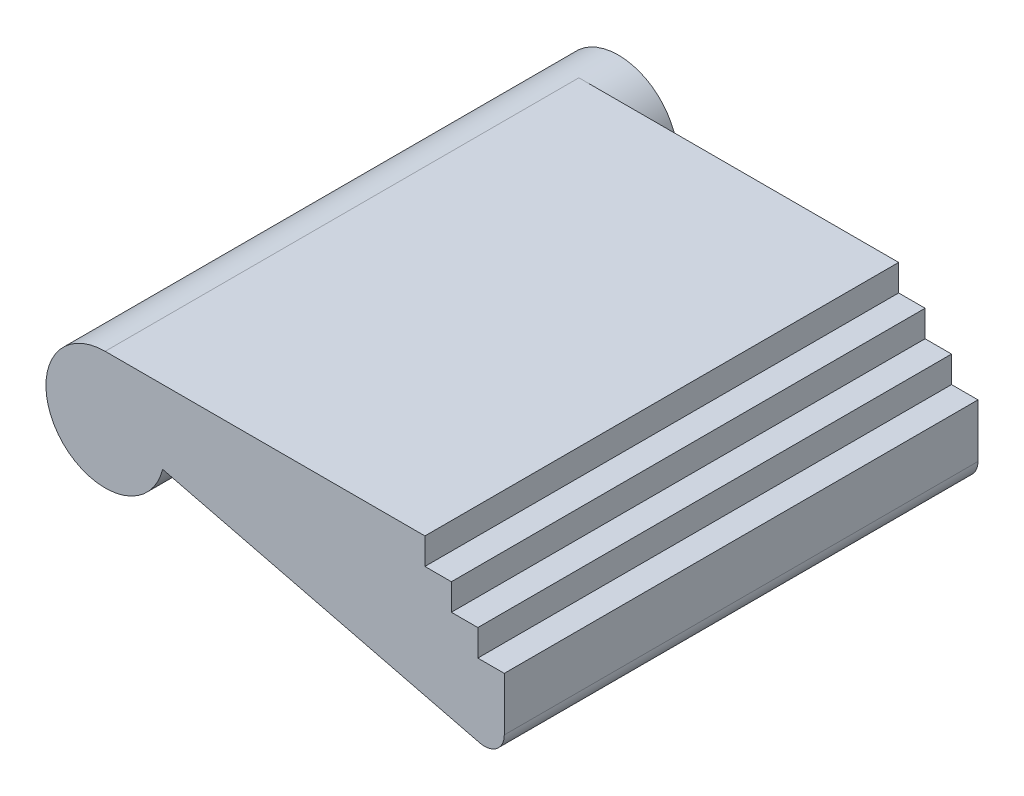
ISO-10303-21;
HEADER;
FILE_DESCRIPTION(('STEP AP214'),'2;1');
FILE_NAME('part.step','',(''),(''),'','','');
FILE_SCHEMA(('AUTOMOTIVE_DESIGN { 1 0 10303 214 1 1 1 1 }'));
ENDSEC;
DATA;
#1=APPLICATION_CONTEXT('core data for automotive mechanical design processes');
#2=APPLICATION_PROTOCOL_DEFINITION('international standard','automotive_design',2000,#1);
#3=PRODUCT_CONTEXT('',#1,'mechanical');
#4=PRODUCT('Part','Part','',(#3));
#5=PRODUCT_RELATED_PRODUCT_CATEGORY('part','',(#4));
#6=PRODUCT_DEFINITION_FORMATION('','',#4);
#7=PRODUCT_DEFINITION_CONTEXT('part definition',#1,'design');
#8=PRODUCT_DEFINITION('design','',#6,#7);
#9=PRODUCT_DEFINITION_SHAPE('','',#8);
#10=(LENGTH_UNIT() NAMED_UNIT(*) SI_UNIT(.MILLI.,.METRE.));
#11=(NAMED_UNIT(*) PLANE_ANGLE_UNIT() SI_UNIT($,.RADIAN.));
#12=(NAMED_UNIT(*) SI_UNIT($,.STERADIAN.) SOLID_ANGLE_UNIT());
#13=UNCERTAINTY_MEASURE_WITH_UNIT(LENGTH_MEASURE(1.E-05),#10,'distance_accuracy_value','');
#14=(GEOMETRIC_REPRESENTATION_CONTEXT(3) GLOBAL_UNCERTAINTY_ASSIGNED_CONTEXT((#13)) GLOBAL_UNIT_ASSIGNED_CONTEXT((#10,
#11,#12)) REPRESENTATION_CONTEXT('',''));
#15=CARTESIAN_POINT('',(0.,0.,0.));
#16=DIRECTION('',(0.,0.,1.));
#17=DIRECTION('',(1.,0.,0.));
#18=AXIS2_PLACEMENT_3D('',#15,#16,#17);
#19=CARTESIAN_POINT('',(0.,0.,13.));
#20=DIRECTION('',(0.,0.,-1.));
#21=DIRECTION('',(-1.,0.,0.));
#22=AXIS2_PLACEMENT_3D('',#19,#20,#21);
#23=CYLINDRICAL_SURFACE('',#22,1.5);
#24=CARTESIAN_POINT('',(0.,0.,13.));
#25=DIRECTION('',(0.,0.,1.));
#26=DIRECTION('',(1.,0.,0.));
#27=AXIS2_PLACEMENT_3D('',#24,#25,#26);
#28=CIRCLE('',#27,1.5);
#29=CARTESIAN_POINT('',(0.,1.5,13.));
#30=VERTEX_POINT('',#29);
#31=CARTESIAN_POINT('',(1.45614093271806,-0.360074414618708,13.));
#32=VERTEX_POINT('',#31);
#33=EDGE_CURVE('E195',#30,#32,#28,.T.);
#34=ORIENTED_EDGE('',*,*,#33,.F.);
#35=DIRECTION('',(0.,0.,1.));
#36=VECTOR('',#35,1.);
#37=CARTESIAN_POINT('',(0.,1.5,0.999999999999999));
#38=LINE('',#37,#36);
#39=CARTESIAN_POINT('',(0.,1.5,0.999999999999999));
#40=VERTEX_POINT('',#39);
#41=EDGE_CURVE('E177',#40,#30,#38,.T.);
#42=ORIENTED_EDGE('',*,*,#41,.F.);
#43=CARTESIAN_POINT('',(0.,0.,0.999999999999999));
#44=DIRECTION('',(0.,0.,-1.));
#45=DIRECTION('',(-1.,0.,0.));
#46=AXIS2_PLACEMENT_3D('',#43,#44,#45);
#47=CIRCLE('',#46,1.5);
#48=CARTESIAN_POINT('',(1.45614093271805,-0.360074414618707,0.999999999999999));
#49=VERTEX_POINT('',#48);
#50=EDGE_CURVE('E198',#40,#49,#47,.T.);
#51=ORIENTED_EDGE('',*,*,#50,.T.);
#52=DIRECTION('',(0.,0.,-1.));
#53=VECTOR('',#52,1.);
#54=CARTESIAN_POINT('',(1.45614093271805,-0.360074414618706,13.));
#55=LINE('',#54,#53);
#56=EDGE_CURVE('E180',#49,#32,#55,.F.);
#57=ORIENTED_EDGE('',*,*,#56,.T.);
#58=EDGE_LOOP('',(#34,#42,#51,#57));
#59=FACE_BOUND('',#58,.T.);
#60=CARTESIAN_POINT('',(0.,0.,0.));
#61=DIRECTION('',(0.,0.,1.));
#62=DIRECTION('',(1.,0.,0.));
#63=AXIS2_PLACEMENT_3D('',#60,#61,#62);
#64=CIRCLE('',#63,1.5);
#65=CARTESIAN_POINT('',(1.5,0.,0.));
#66=VERTEX_POINT('',#65);
#67=EDGE_CURVE('E194',#66,#66,#64,.T.);
#68=ORIENTED_EDGE('',*,*,#67,.T.);
#69=EDGE_LOOP('',(#68));
#70=FACE_BOUND('',#69,.T.);
#71=ADVANCED_FACE('F34',(#59,#70),#23,.T.);
#72=CARTESIAN_POINT('',(0.,0.,13.));
#73=DIRECTION('',(0.,0.,1.));
#74=DIRECTION('',(1.,0.,0.));
#75=AXIS2_PLACEMENT_3D('',#72,#73,#74);
#76=PLANE('',#75);
#77=DIRECTION('',(0.970760621812034,-0.240049609745805,0.));
#78=VECTOR('',#77,1.);
#79=CARTESIAN_POINT('',(10.11,-2.5,13.));
#80=LINE('',#79,#78);
#81=CARTESIAN_POINT('',(9.4899751951271,-2.34668031531333,13.));
#82=VERTEX_POINT('',#81);
#83=EDGE_CURVE('E155',#32,#82,#80,.T.);
#84=ORIENTED_EDGE('',*,*,#83,.T.);
#85=CARTESIAN_POINT('',(9.61,-1.86130000440731,13.));
#86=DIRECTION('',(0.,0.,1.));
#87=DIRECTION('',(1.,0.,0.));
#88=AXIS2_PLACEMENT_3D('',#85,#86,#87);
#89=CIRCLE('',#88,0.5);
#90=CARTESIAN_POINT('',(10.11,-1.86130000440731,13.));
#91=VERTEX_POINT('',#90);
#92=EDGE_CURVE('E56',#82,#91,#89,.T.);
#93=ORIENTED_EDGE('',*,*,#92,.T.);
#94=DIRECTION('',(0.,1.,0.));
#95=VECTOR('',#94,1.);
#96=CARTESIAN_POINT('',(10.11,-0.51,13.));
#97=LINE('',#96,#95);
#98=CARTESIAN_POINT('',(10.11,-0.51,13.));
#99=VERTEX_POINT('',#98);
#100=EDGE_CURVE('E157',#91,#99,#97,.T.);
#101=ORIENTED_EDGE('',*,*,#100,.T.);
#102=DIRECTION('',(-1.,0.,0.));
#103=VECTOR('',#102,1.);
#104=CARTESIAN_POINT('',(9.44,-0.51,13.));
#105=LINE('',#104,#103);
#106=CARTESIAN_POINT('',(9.44,-0.51,13.));
#107=VERTEX_POINT('',#106);
#108=EDGE_CURVE('E128',#99,#107,#105,.T.);
#109=ORIENTED_EDGE('',*,*,#108,.T.);
#110=DIRECTION('',(0.,1.,0.));
#111=VECTOR('',#110,1.);
#112=CARTESIAN_POINT('',(9.44,0.16,13.));
#113=LINE('',#112,#111);
#114=CARTESIAN_POINT('',(9.44,0.16,13.));
#115=VERTEX_POINT('',#114);
#116=EDGE_CURVE('E160',#107,#115,#113,.T.);
#117=ORIENTED_EDGE('',*,*,#116,.T.);
#118=DIRECTION('',(-1.,0.,0.));
#119=VECTOR('',#118,1.);
#120=CARTESIAN_POINT('',(8.77,0.16,13.));
#121=LINE('',#120,#119);
#122=CARTESIAN_POINT('',(8.77,0.16,13.));
#123=VERTEX_POINT('',#122);
#124=EDGE_CURVE('E163',#115,#123,#121,.T.);
#125=ORIENTED_EDGE('',*,*,#124,.T.);
#126=DIRECTION('',(0.,1.,0.));
#127=VECTOR('',#126,1.);
#128=CARTESIAN_POINT('',(8.77,0.83,13.));
#129=LINE('',#128,#127);
#130=CARTESIAN_POINT('',(8.77,0.83,13.));
#131=VERTEX_POINT('',#130);
#132=EDGE_CURVE('E166',#123,#131,#129,.T.);
#133=ORIENTED_EDGE('',*,*,#132,.T.);
#134=DIRECTION('',(-1.,0.,0.));
#135=VECTOR('',#134,1.);
#136=CARTESIAN_POINT('',(8.1,0.83,13.));
#137=LINE('',#136,#135);
#138=CARTESIAN_POINT('',(8.1,0.83,13.));
#139=VERTEX_POINT('',#138);
#140=EDGE_CURVE('E169',#131,#139,#137,.T.);
#141=ORIENTED_EDGE('',*,*,#140,.T.);
#142=DIRECTION('',(0.,1.,0.));
#143=VECTOR('',#142,1.);
#144=CARTESIAN_POINT('',(8.1,1.5,13.));
#145=LINE('',#144,#143);
#146=CARTESIAN_POINT('',(8.1,1.5,13.));
#147=VERTEX_POINT('',#146);
#148=EDGE_CURVE('E172',#139,#147,#145,.T.);
#149=ORIENTED_EDGE('',*,*,#148,.T.);
#150=DIRECTION('',(-1.,0.,0.));
#151=VECTOR('',#150,1.);
#152=CARTESIAN_POINT('',(0.,1.5,13.));
#153=LINE('',#152,#151);
#154=EDGE_CURVE('E175',#147,#30,#153,.T.);
#155=ORIENTED_EDGE('',*,*,#154,.T.);
#156=ORIENTED_EDGE('',*,*,#33,.T.);
#157=EDGE_LOOP('',(#84,#93,#101,#109,#117,#125,#133,#141,#149,#155,#156));
#158=FACE_BOUND('',#157,.T.);
#159=ADVANCED_FACE('F212',(#158),#76,.T.);
#160=CARTESIAN_POINT('',(0.,0.,0.));
#161=DIRECTION('',(0.,0.,1.));
#162=DIRECTION('',(1.,0.,0.));
#163=AXIS2_PLACEMENT_3D('',#160,#161,#162);
#164=PLANE('',#163);
#165=ORIENTED_EDGE('',*,*,#67,.F.);
#166=EDGE_LOOP('',(#165));
#167=FACE_BOUND('',#166,.T.);
#168=ADVANCED_FACE('F228',(#167),#164,.F.);
#169=CARTESIAN_POINT('',(10.11,-2.5,0.999999999999999));
#170=DIRECTION('',(-0.240049609745805,-0.970760621812034,0.));
#171=DIRECTION('',(0.970760621812034,-0.240049609745805,0.));
#172=AXIS2_PLACEMENT_3D('',#169,#170,#171);
#173=PLANE('',#172);
#174=DIRECTION('',(0.970760621812034,-0.240049609745805,0.));
#175=VECTOR('',#174,1.);
#176=CARTESIAN_POINT('',(10.11,-2.5,0.999999999999999));
#177=LINE('',#176,#175);
#178=CARTESIAN_POINT('',(9.4899751951271,-2.34668031531333,0.999999999999999));
#179=VERTEX_POINT('',#178);
#180=EDGE_CURVE('E122',#49,#179,#177,.T.);
#181=ORIENTED_EDGE('',*,*,#180,.T.);
#182=DIRECTION('',(0.,0.,1.));
#183=VECTOR('',#182,1.);
#184=CARTESIAN_POINT('',(9.4899751951271,-2.34668031531333,0.999999999999999));
#185=LINE('',#184,#183);
#186=EDGE_CURVE('E203',#179,#82,#185,.T.);
#187=ORIENTED_EDGE('',*,*,#186,.T.);
#188=ORIENTED_EDGE('',*,*,#83,.F.);
#189=ORIENTED_EDGE('',*,*,#56,.F.);
#190=EDGE_LOOP('',(#181,#187,#188,#189));
#191=FACE_BOUND('',#190,.T.);
#192=ADVANCED_FACE('F209',(#191),#173,.T.);
#193=CARTESIAN_POINT('',(0.,1.5,0.999999999999999));
#194=DIRECTION('',(0.,1.,0.));
#195=DIRECTION('',(0.,0.,1.));
#196=AXIS2_PLACEMENT_3D('',#193,#194,#195);
#197=PLANE('',#196);
#198=ORIENTED_EDGE('',*,*,#154,.F.);
#199=DIRECTION('',(0.,0.,1.));
#200=VECTOR('',#199,1.);
#201=CARTESIAN_POINT('',(8.1,1.5,0.999999999999999));
#202=LINE('',#201,#200);
#203=CARTESIAN_POINT('',(8.1,1.5,0.999999999999999));
#204=VERTEX_POINT('',#203);
#205=EDGE_CURVE('E181',#204,#147,#202,.T.);
#206=ORIENTED_EDGE('',*,*,#205,.F.);
#207=DIRECTION('',(-1.,0.,0.));
#208=VECTOR('',#207,1.);
#209=CARTESIAN_POINT('',(0.,1.5,0.999999999999999));
#210=LINE('',#209,#208);
#211=EDGE_CURVE('E130',#204,#40,#210,.T.);
#212=ORIENTED_EDGE('',*,*,#211,.T.);
#213=ORIENTED_EDGE('',*,*,#41,.T.);
#214=EDGE_LOOP('',(#198,#206,#212,#213));
#215=FACE_BOUND('',#214,.T.);
#216=ADVANCED_FACE('F236',(#215),#197,.T.);
#217=CARTESIAN_POINT('',(8.1,1.5,0.999999999999999));
#218=DIRECTION('',(1.,0.,0.));
#219=DIRECTION('',(0.,0.,-1.));
#220=AXIS2_PLACEMENT_3D('',#217,#218,#219);
#221=PLANE('',#220);
#222=ORIENTED_EDGE('',*,*,#148,.F.);
#223=DIRECTION('',(0.,0.,1.));
#224=VECTOR('',#223,1.);
#225=CARTESIAN_POINT('',(8.1,0.83,0.999999999999999));
#226=LINE('',#225,#224);
#227=CARTESIAN_POINT('',(8.1,0.83,0.999999999999999));
#228=VERTEX_POINT('',#227);
#229=EDGE_CURVE('E183',#228,#139,#226,.T.);
#230=ORIENTED_EDGE('',*,*,#229,.F.);
#231=DIRECTION('',(0.,1.,0.));
#232=VECTOR('',#231,1.);
#233=CARTESIAN_POINT('',(8.1,1.5,0.999999999999999));
#234=LINE('',#233,#232);
#235=EDGE_CURVE('E150',#228,#204,#234,.T.);
#236=ORIENTED_EDGE('',*,*,#235,.T.);
#237=ORIENTED_EDGE('',*,*,#205,.T.);
#238=EDGE_LOOP('',(#222,#230,#236,#237));
#239=FACE_BOUND('',#238,.T.);
#240=ADVANCED_FACE('F256',(#239),#221,.T.);
#241=CARTESIAN_POINT('',(8.1,0.83,0.999999999999999));
#242=DIRECTION('',(0.,1.,0.));
#243=DIRECTION('',(0.,0.,1.));
#244=AXIS2_PLACEMENT_3D('',#241,#242,#243);
#245=PLANE('',#244);
#246=ORIENTED_EDGE('',*,*,#140,.F.);
#247=DIRECTION('',(0.,0.,1.));
#248=VECTOR('',#247,1.);
#249=CARTESIAN_POINT('',(8.77,0.83,0.999999999999999));
#250=LINE('',#249,#248);
#251=CARTESIAN_POINT('',(8.77,0.83,0.999999999999999));
#252=VERTEX_POINT('',#251);
#253=EDGE_CURVE('E185',#252,#131,#250,.T.);
#254=ORIENTED_EDGE('',*,*,#253,.F.);
#255=DIRECTION('',(-1.,0.,0.));
#256=VECTOR('',#255,1.);
#257=CARTESIAN_POINT('',(8.1,0.83,0.999999999999999));
#258=LINE('',#257,#256);
#259=EDGE_CURVE('E147',#252,#228,#258,.T.);
#260=ORIENTED_EDGE('',*,*,#259,.T.);
#261=ORIENTED_EDGE('',*,*,#229,.T.);
#262=EDGE_LOOP('',(#246,#254,#260,#261));
#263=FACE_BOUND('',#262,.T.);
#264=ADVANCED_FACE('F252',(#263),#245,.T.);
#265=CARTESIAN_POINT('',(8.77,0.83,0.999999999999999));
#266=DIRECTION('',(1.,0.,0.));
#267=DIRECTION('',(0.,0.,-1.));
#268=AXIS2_PLACEMENT_3D('',#265,#266,#267);
#269=PLANE('',#268);
#270=ORIENTED_EDGE('',*,*,#132,.F.);
#271=DIRECTION('',(0.,0.,1.));
#272=VECTOR('',#271,1.);
#273=CARTESIAN_POINT('',(8.77,0.16,0.999999999999999));
#274=LINE('',#273,#272);
#275=CARTESIAN_POINT('',(8.77,0.16,0.999999999999999));
#276=VERTEX_POINT('',#275);
#277=EDGE_CURVE('E187',#276,#123,#274,.T.);
#278=ORIENTED_EDGE('',*,*,#277,.F.);
#279=DIRECTION('',(0.,1.,0.));
#280=VECTOR('',#279,1.);
#281=CARTESIAN_POINT('',(8.77,0.83,0.999999999999999));
#282=LINE('',#281,#280);
#283=EDGE_CURVE('E144',#276,#252,#282,.T.);
#284=ORIENTED_EDGE('',*,*,#283,.T.);
#285=ORIENTED_EDGE('',*,*,#253,.T.);
#286=EDGE_LOOP('',(#270,#278,#284,#285));
#287=FACE_BOUND('',#286,.T.);
#288=ADVANCED_FACE('F248',(#287),#269,.T.);
#289=CARTESIAN_POINT('',(8.77,0.16,0.999999999999999));
#290=DIRECTION('',(0.,1.,0.));
#291=DIRECTION('',(0.,0.,1.));
#292=AXIS2_PLACEMENT_3D('',#289,#290,#291);
#293=PLANE('',#292);
#294=ORIENTED_EDGE('',*,*,#124,.F.);
#295=DIRECTION('',(0.,0.,1.));
#296=VECTOR('',#295,1.);
#297=CARTESIAN_POINT('',(9.44,0.16,0.999999999999999));
#298=LINE('',#297,#296);
#299=CARTESIAN_POINT('',(9.44,0.16,0.999999999999999));
#300=VERTEX_POINT('',#299);
#301=EDGE_CURVE('E189',#300,#115,#298,.T.);
#302=ORIENTED_EDGE('',*,*,#301,.F.);
#303=DIRECTION('',(-1.,0.,0.));
#304=VECTOR('',#303,1.);
#305=CARTESIAN_POINT('',(8.77,0.16,0.999999999999999));
#306=LINE('',#305,#304);
#307=EDGE_CURVE('E138',#300,#276,#306,.T.);
#308=ORIENTED_EDGE('',*,*,#307,.T.);
#309=ORIENTED_EDGE('',*,*,#277,.T.);
#310=EDGE_LOOP('',(#294,#302,#308,#309));
#311=FACE_BOUND('',#310,.T.);
#312=ADVANCED_FACE('F244',(#311),#293,.T.);
#313=CARTESIAN_POINT('',(9.44,0.16,0.999999999999999));
#314=DIRECTION('',(1.,0.,0.));
#315=DIRECTION('',(0.,0.,-1.));
#316=AXIS2_PLACEMENT_3D('',#313,#314,#315);
#317=PLANE('',#316);
#318=ORIENTED_EDGE('',*,*,#116,.F.);
#319=DIRECTION('',(0.,0.,1.));
#320=VECTOR('',#319,1.);
#321=CARTESIAN_POINT('',(9.44,-0.51,0.999999999999999));
#322=LINE('',#321,#320);
#323=CARTESIAN_POINT('',(9.44,-0.51,0.999999999999999));
#324=VERTEX_POINT('',#323);
#325=EDGE_CURVE('E129',#324,#107,#322,.T.);
#326=ORIENTED_EDGE('',*,*,#325,.F.);
#327=DIRECTION('',(0.,1.,0.));
#328=VECTOR('',#327,1.);
#329=CARTESIAN_POINT('',(9.44,0.16,0.999999999999999));
#330=LINE('',#329,#328);
#331=EDGE_CURVE('E136',#324,#300,#330,.T.);
#332=ORIENTED_EDGE('',*,*,#331,.T.);
#333=ORIENTED_EDGE('',*,*,#301,.T.);
#334=EDGE_LOOP('',(#318,#326,#332,#333));
#335=FACE_BOUND('',#334,.T.);
#336=ADVANCED_FACE('F241',(#335),#317,.T.);
#337=CARTESIAN_POINT('',(9.44,-0.51,0.999999999999999));
#338=DIRECTION('',(0.,1.,0.));
#339=DIRECTION('',(-1.,0.,0.));
#340=AXIS2_PLACEMENT_3D('',#337,#338,#339);
#341=PLANE('',#340);
#342=ORIENTED_EDGE('',*,*,#108,.F.);
#343=DIRECTION('',(0.,0.,1.));
#344=VECTOR('',#343,1.);
#345=CARTESIAN_POINT('',(10.11,-0.51,0.999999999999999));
#346=LINE('',#345,#344);
#347=CARTESIAN_POINT('',(10.11,-0.51,0.999999999999999));
#348=VERTEX_POINT('',#347);
#349=EDGE_CURVE('E116',#348,#99,#346,.T.);
#350=ORIENTED_EDGE('',*,*,#349,.F.);
#351=DIRECTION('',(-1.,0.,0.));
#352=VECTOR('',#351,1.);
#353=CARTESIAN_POINT('',(9.44,-0.51,0.999999999999999));
#354=LINE('',#353,#352);
#355=EDGE_CURVE('E121',#348,#324,#354,.T.);
#356=ORIENTED_EDGE('',*,*,#355,.T.);
#357=ORIENTED_EDGE('',*,*,#325,.T.);
#358=EDGE_LOOP('',(#342,#350,#356,#357));
#359=FACE_BOUND('',#358,.T.);
#360=ADVANCED_FACE('F126',(#359),#341,.T.);
#361=CARTESIAN_POINT('',(10.11,-0.51,0.999999999999999));
#362=DIRECTION('',(1.,0.,0.));
#363=DIRECTION('',(0.,0.,-1.));
#364=AXIS2_PLACEMENT_3D('',#361,#362,#363);
#365=PLANE('',#364);
#366=ORIENTED_EDGE('',*,*,#100,.F.);
#367=DIRECTION('',(0.,0.,1.));
#368=VECTOR('',#367,1.);
#369=CARTESIAN_POINT('',(10.11,-1.86130000440731,0.999999999999999));
#370=LINE('',#369,#368);
#371=CARTESIAN_POINT('',(10.11,-1.86130000440731,0.999999999999999));
#372=VERTEX_POINT('',#371);
#373=EDGE_CURVE('E42',#91,#372,#370,.F.);
#374=ORIENTED_EDGE('',*,*,#373,.T.);
#375=DIRECTION('',(0.,1.,0.));
#376=VECTOR('',#375,1.);
#377=CARTESIAN_POINT('',(10.11,-0.51,0.999999999999999));
#378=LINE('',#377,#376);
#379=EDGE_CURVE('E113',#372,#348,#378,.T.);
#380=ORIENTED_EDGE('',*,*,#379,.T.);
#381=ORIENTED_EDGE('',*,*,#349,.T.);
#382=EDGE_LOOP('',(#366,#374,#380,#381));
#383=FACE_BOUND('',#382,.T.);
#384=ADVANCED_FACE('F115',(#383),#365,.T.);
#385=CARTESIAN_POINT('',(0.,0.,0.999999999999999));
#386=DIRECTION('',(0.,0.,-1.));
#387=DIRECTION('',(-1.,0.,0.));
#388=AXIS2_PLACEMENT_3D('',#385,#386,#387);
#389=PLANE('',#388);
#390=ORIENTED_EDGE('',*,*,#379,.F.);
#391=CARTESIAN_POINT('',(9.61,-1.86130000440731,0.999999999999999));
#392=DIRECTION('',(0.,0.,-1.));
#393=DIRECTION('',(-1.,0.,0.));
#394=AXIS2_PLACEMENT_3D('',#391,#392,#393);
#395=CIRCLE('',#394,0.5);
#396=EDGE_CURVE('E11',#372,#179,#395,.T.);
#397=ORIENTED_EDGE('',*,*,#396,.T.);
#398=ORIENTED_EDGE('',*,*,#180,.F.);
#399=ORIENTED_EDGE('',*,*,#50,.F.);
#400=ORIENTED_EDGE('',*,*,#211,.F.);
#401=ORIENTED_EDGE('',*,*,#235,.F.);
#402=ORIENTED_EDGE('',*,*,#259,.F.);
#403=ORIENTED_EDGE('',*,*,#283,.F.);
#404=ORIENTED_EDGE('',*,*,#307,.F.);
#405=ORIENTED_EDGE('',*,*,#331,.F.);
#406=ORIENTED_EDGE('',*,*,#355,.F.);
#407=EDGE_LOOP('',(#390,#397,#398,#399,#400,#401,#402,#403,#404,#405,#406));
#408=FACE_BOUND('',#407,.T.);
#409=ADVANCED_FACE('F133',(#408),#389,.T.);
#410=CARTESIAN_POINT('',(9.61,-1.86130000440731,0.999999999999999));
#411=DIRECTION('',(0.,0.,1.));
#412=DIRECTION('',(1.,0.,0.));
#413=AXIS2_PLACEMENT_3D('',#410,#411,#412);
#414=CYLINDRICAL_SURFACE('',#413,0.5);
#415=ORIENTED_EDGE('',*,*,#396,.F.);
#416=ORIENTED_EDGE('',*,*,#373,.F.);
#417=ORIENTED_EDGE('',*,*,#92,.F.);
#418=ORIENTED_EDGE('',*,*,#186,.F.);
#419=EDGE_LOOP('',(#415,#416,#417,#418));
#420=FACE_BOUND('',#419,.T.);
#421=ADVANCED_FACE('F36',(#420),#414,.T.);
#422=CLOSED_SHELL('',(#71,#159,#168,#192,#216,#240,#264,#288,#312,#336,#360,#384,#409,#421));
#423=MANIFOLD_SOLID_BREP('B2',#422);
#424=ADVANCED_BREP_SHAPE_REPRESENTATION('',(#18,#423),#14);
#425=SHAPE_DEFINITION_REPRESENTATION(#9,#424);
ENDSEC;
END-ISO-10303-21;
